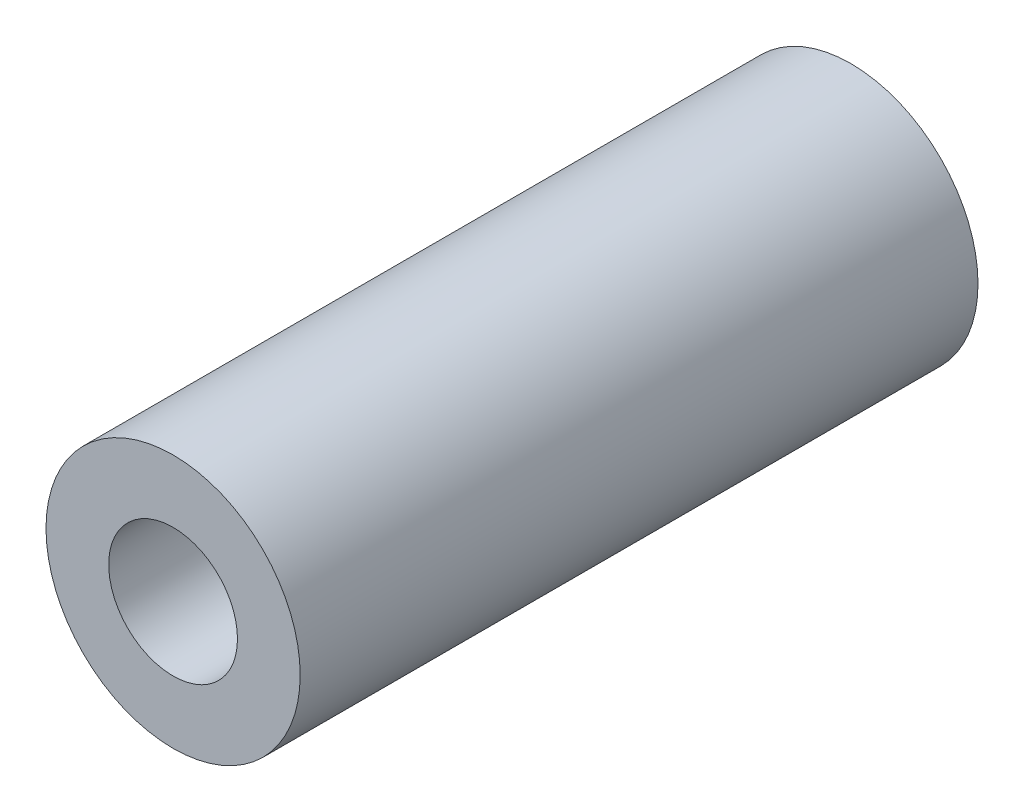
ISO-10303-21;
HEADER;
FILE_DESCRIPTION(('STEP AP214'),'2;1');
FILE_NAME('part.step','',(''),(''),'','','');
FILE_SCHEMA(('AUTOMOTIVE_DESIGN { 1 0 10303 214 1 1 1 1 }'));
ENDSEC;
DATA;
#1=APPLICATION_CONTEXT('core data for automotive mechanical design processes');
#2=APPLICATION_PROTOCOL_DEFINITION('international standard','automotive_design',2000,#1);
#3=PRODUCT_CONTEXT('',#1,'mechanical');
#4=PRODUCT('Part','Part','',(#3));
#5=PRODUCT_RELATED_PRODUCT_CATEGORY('part','',(#4));
#6=PRODUCT_DEFINITION_FORMATION('','',#4);
#7=PRODUCT_DEFINITION_CONTEXT('part definition',#1,'design');
#8=PRODUCT_DEFINITION('design','',#6,#7);
#9=PRODUCT_DEFINITION_SHAPE('','',#8);
#10=(LENGTH_UNIT() NAMED_UNIT(*) SI_UNIT(.MILLI.,.METRE.));
#11=(NAMED_UNIT(*) PLANE_ANGLE_UNIT() SI_UNIT($,.RADIAN.));
#12=(NAMED_UNIT(*) SI_UNIT($,.STERADIAN.) SOLID_ANGLE_UNIT());
#13=UNCERTAINTY_MEASURE_WITH_UNIT(LENGTH_MEASURE(1.E-05),#10,'distance_accuracy_value','');
#14=(GEOMETRIC_REPRESENTATION_CONTEXT(3) GLOBAL_UNCERTAINTY_ASSIGNED_CONTEXT((#13)) GLOBAL_UNIT_ASSIGNED_CONTEXT((#10,
#11,#12)) REPRESENTATION_CONTEXT('',''));
#15=CARTESIAN_POINT('',(0.,0.,0.));
#16=DIRECTION('',(0.,0.,1.));
#17=DIRECTION('',(1.,0.,0.));
#18=AXIS2_PLACEMENT_3D('',#15,#16,#17);
#19=CARTESIAN_POINT('',(0.,0.,50.8));
#20=DIRECTION('',(0.,0.,1.));
#21=DIRECTION('',(1.,0.,0.));
#22=AXIS2_PLACEMENT_3D('',#19,#20,#21);
#23=PLANE('',#22);
#24=CARTESIAN_POINT('',(0.,0.,50.8));
#25=DIRECTION('',(0.,0.,1.));
#26=DIRECTION('',(1.,0.,0.));
#27=AXIS2_PLACEMENT_3D('',#24,#25,#26);
#28=CIRCLE('',#27,9.525);
#29=CARTESIAN_POINT('',(9.525,0.,50.8));
#30=VERTEX_POINT('',#29);
#31=EDGE_CURVE('E10',#30,#30,#28,.T.);
#32=ORIENTED_EDGE('',*,*,#31,.T.);
#33=EDGE_LOOP('',(#32));
#34=FACE_BOUND('',#33,.T.);
#35=CARTESIAN_POINT('',(0.,0.,50.8));
#36=DIRECTION('',(0.,0.,1.));
#37=DIRECTION('',(1.,0.,0.));
#38=AXIS2_PLACEMENT_3D('',#35,#36,#37);
#39=CIRCLE('',#38,4.826);
#40=CARTESIAN_POINT('',(4.826,0.,50.8));
#41=VERTEX_POINT('',#40);
#42=EDGE_CURVE('E56',#41,#41,#39,.T.);
#43=ORIENTED_EDGE('',*,*,#42,.F.);
#44=EDGE_LOOP('',(#43));
#45=FACE_BOUND('',#44,.T.);
#46=ADVANCED_FACE('F41',(#34,#45),#23,.T.);
#47=CARTESIAN_POINT('',(0.,0.,0.));
#48=DIRECTION('',(0.,0.,1.));
#49=DIRECTION('',(1.,0.,0.));
#50=AXIS2_PLACEMENT_3D('',#47,#48,#49);
#51=PLANE('',#50);
#52=CARTESIAN_POINT('',(0.,0.,0.));
#53=DIRECTION('',(0.,0.,1.));
#54=DIRECTION('',(1.,0.,0.));
#55=AXIS2_PLACEMENT_3D('',#52,#53,#54);
#56=CIRCLE('',#55,9.525);
#57=CARTESIAN_POINT('',(9.525,0.,0.));
#58=VERTEX_POINT('',#57);
#59=EDGE_CURVE('E45',#58,#58,#56,.T.);
#60=ORIENTED_EDGE('',*,*,#59,.F.);
#61=EDGE_LOOP('',(#60));
#62=FACE_BOUND('',#61,.T.);
#63=CARTESIAN_POINT('',(0.,0.,0.));
#64=DIRECTION('',(0.,0.,1.));
#65=DIRECTION('',(1.,0.,0.));
#66=AXIS2_PLACEMENT_3D('',#63,#64,#65);
#67=CIRCLE('',#66,4.826);
#68=CARTESIAN_POINT('',(4.826,0.,0.));
#69=VERTEX_POINT('',#68);
#70=EDGE_CURVE('E58',#69,#69,#67,.T.);
#71=ORIENTED_EDGE('',*,*,#70,.T.);
#72=EDGE_LOOP('',(#71));
#73=FACE_BOUND('',#72,.T.);
#74=ADVANCED_FACE('F71',(#62,#73),#51,.F.);
#75=CARTESIAN_POINT('',(0.,0.,50.8));
#76=DIRECTION('',(0.,0.,-1.));
#77=DIRECTION('',(-1.,0.,0.));
#78=AXIS2_PLACEMENT_3D('',#75,#76,#77);
#79=CYLINDRICAL_SURFACE('',#78,9.525);
#80=ORIENTED_EDGE('',*,*,#31,.F.);
#81=EDGE_LOOP('',(#80));
#82=FACE_BOUND('',#81,.T.);
#83=ORIENTED_EDGE('',*,*,#59,.T.);
#84=EDGE_LOOP('',(#83));
#85=FACE_BOUND('',#84,.T.);
#86=ADVANCED_FACE('F43',(#82,#85),#79,.T.);
#87=CARTESIAN_POINT('',(0.,0.,50.8));
#88=DIRECTION('',(0.,0.,-1.));
#89=DIRECTION('',(-1.,0.,0.));
#90=AXIS2_PLACEMENT_3D('',#87,#88,#89);
#91=CYLINDRICAL_SURFACE('',#90,4.826);
#92=ORIENTED_EDGE('',*,*,#42,.T.);
#93=EDGE_LOOP('',(#92));
#94=FACE_BOUND('',#93,.T.);
#95=ORIENTED_EDGE('',*,*,#70,.F.);
#96=EDGE_LOOP('',(#95));
#97=FACE_BOUND('',#96,.T.);
#98=ADVANCED_FACE('F67',(#94,#97),#91,.F.);
#99=CLOSED_SHELL('',(#46,#74,#86,#98));
#100=MANIFOLD_SOLID_BREP('B2',#99);
#101=ADVANCED_BREP_SHAPE_REPRESENTATION('',(#18,#100),#14);
#102=SHAPE_DEFINITION_REPRESENTATION(#9,#101);
ENDSEC;
END-ISO-10303-21;
